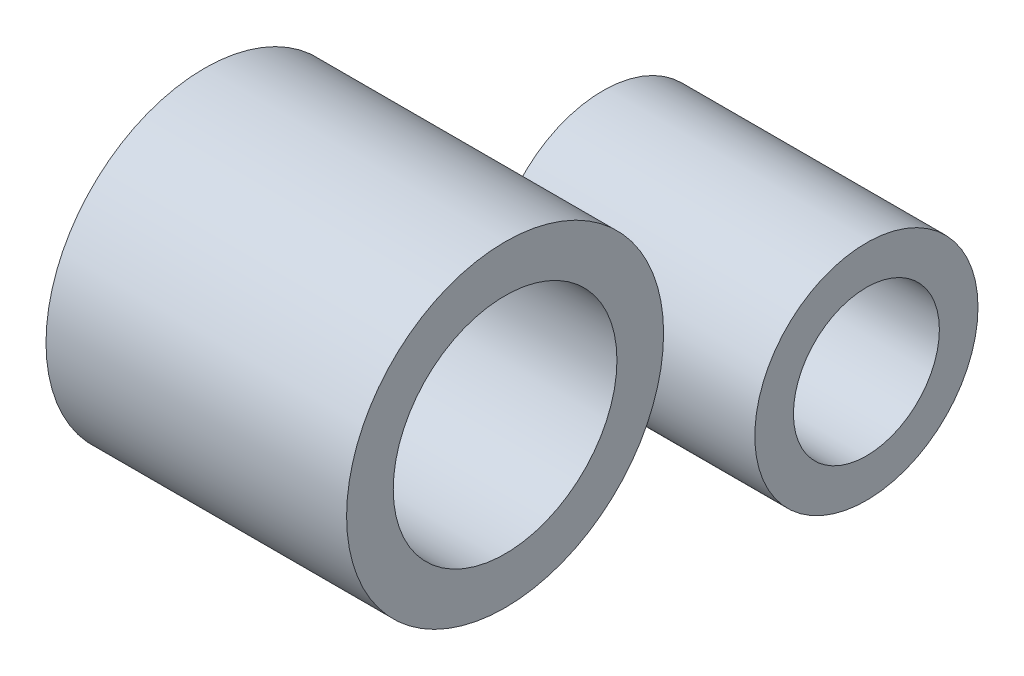
ISO-10303-21;
HEADER;
FILE_DESCRIPTION(('STEP AP214'),'2;1');
FILE_NAME('part.step','',(''),(''),'','','');
FILE_SCHEMA(('AUTOMOTIVE_DESIGN { 1 0 10303 214 1 1 1 1 }'));
ENDSEC;
DATA;
#1=APPLICATION_CONTEXT('core data for automotive mechanical design processes');
#2=APPLICATION_PROTOCOL_DEFINITION('international standard','automotive_design',2000,#1);
#3=PRODUCT_CONTEXT('',#1,'mechanical');
#4=PRODUCT('Part','Part','',(#3));
#5=PRODUCT_RELATED_PRODUCT_CATEGORY('part','',(#4));
#6=PRODUCT_DEFINITION_FORMATION('','',#4);
#7=PRODUCT_DEFINITION_CONTEXT('part definition',#1,'design');
#8=PRODUCT_DEFINITION('design','',#6,#7);
#9=PRODUCT_DEFINITION_SHAPE('','',#8);
#10=(LENGTH_UNIT() NAMED_UNIT(*) SI_UNIT(.MILLI.,.METRE.));
#11=(NAMED_UNIT(*) PLANE_ANGLE_UNIT() SI_UNIT($,.RADIAN.));
#12=(NAMED_UNIT(*) SI_UNIT($,.STERADIAN.) SOLID_ANGLE_UNIT());
#13=UNCERTAINTY_MEASURE_WITH_UNIT(LENGTH_MEASURE(1.E-05),#10,'distance_accuracy_value','');
#14=(GEOMETRIC_REPRESENTATION_CONTEXT(3) GLOBAL_UNCERTAINTY_ASSIGNED_CONTEXT((#13)) GLOBAL_UNIT_ASSIGNED_CONTEXT((#10,
#11,#12)) REPRESENTATION_CONTEXT('',''));
#15=CARTESIAN_POINT('',(0.,0.,0.));
#16=DIRECTION('',(0.,0.,1.));
#17=DIRECTION('',(1.,0.,0.));
#18=AXIS2_PLACEMENT_3D('',#15,#16,#17);
#19=CARTESIAN_POINT('',(73.0000000000001,41.7058257576741,96.7441671801907));
#20=DIRECTION('',(-1.,0.,0.));
#21=DIRECTION('',(0.,0.,1.));
#22=AXIS2_PLACEMENT_3D('',#19,#20,#21);
#23=CYLINDRICAL_SURFACE('',#22,38.4935027632238);
#24=CARTESIAN_POINT('',(73.0000000000001,41.7058257576741,96.7441671801907));
#25=DIRECTION('',(1.,0.,0.));
#26=DIRECTION('',(0.,0.,-1.));
#27=AXIS2_PLACEMENT_3D('',#24,#25,#26);
#28=CIRCLE('',#27,38.4935027632238);
#29=CARTESIAN_POINT('',(73.0000000000001,41.7058257576741,58.2506644169669));
#30=VERTEX_POINT('',#29);
#31=EDGE_CURVE('E11',#30,#30,#28,.T.);
#32=ORIENTED_EDGE('',*,*,#31,.F.);
#33=EDGE_LOOP('',(#32));
#34=FACE_BOUND('',#33,.T.);
#35=CARTESIAN_POINT('',(0.,41.7058257576741,96.7441671801907));
#36=DIRECTION('',(1.,0.,0.));
#37=DIRECTION('',(0.,0.,-1.));
#38=AXIS2_PLACEMENT_3D('',#35,#36,#37);
#39=CIRCLE('',#38,38.4935027632238);
#40=CARTESIAN_POINT('',(0.,41.7058257576741,58.2506644169669));
#41=VERTEX_POINT('',#40);
#42=EDGE_CURVE('E42',#41,#41,#39,.T.);
#43=ORIENTED_EDGE('',*,*,#42,.T.);
#44=EDGE_LOOP('',(#43));
#45=FACE_BOUND('',#44,.T.);
#46=ADVANCED_FACE('F39',(#34,#45),#23,.T.);
#47=CARTESIAN_POINT('',(73.0000000000001,41.7058257576741,96.7441671801907));
#48=DIRECTION('',(1.,0.,0.));
#49=DIRECTION('',(0.,0.,-1.));
#50=AXIS2_PLACEMENT_3D('',#47,#48,#49);
#51=PLANE('',#50);
#52=CARTESIAN_POINT('',(73.0000000000001,41.7058257576741,96.7441671801907));
#53=DIRECTION('',(1.,0.,0.));
#54=DIRECTION('',(0.,0.,-1.));
#55=AXIS2_PLACEMENT_3D('',#52,#53,#54);
#56=CIRCLE('',#55,27.1657190816108);
#57=CARTESIAN_POINT('',(73.0000000000001,41.7058257576741,69.57844809858));
#58=VERTEX_POINT('',#57);
#59=EDGE_CURVE('E49',#58,#58,#56,.T.);
#60=ORIENTED_EDGE('',*,*,#59,.F.);
#61=EDGE_LOOP('',(#60));
#62=FACE_BOUND('',#61,.T.);
#63=ORIENTED_EDGE('',*,*,#31,.T.);
#64=EDGE_LOOP('',(#63));
#65=FACE_BOUND('',#64,.T.);
#66=ADVANCED_FACE('F62',(#62,#65),#51,.T.);
#67=CARTESIAN_POINT('',(0.,41.7058257576741,96.7441671801907));
#68=DIRECTION('',(1.,0.,0.));
#69=DIRECTION('',(0.,0.,-1.));
#70=AXIS2_PLACEMENT_3D('',#67,#68,#69);
#71=PLANE('',#70);
#72=CARTESIAN_POINT('',(0.,41.7058257576741,96.7441671801907));
#73=DIRECTION('',(-1.,0.,0.));
#74=DIRECTION('',(0.,0.,1.));
#75=AXIS2_PLACEMENT_3D('',#72,#73,#74);
#76=CIRCLE('',#75,27.1657190816108);
#77=CARTESIAN_POINT('',(0.,41.7058257576741,123.909886261802));
#78=VERTEX_POINT('',#77);
#79=EDGE_CURVE('E53',#78,#78,#76,.T.);
#80=ORIENTED_EDGE('',*,*,#79,.F.);
#81=EDGE_LOOP('',(#80));
#82=FACE_BOUND('',#81,.T.);
#83=ORIENTED_EDGE('',*,*,#42,.F.);
#84=EDGE_LOOP('',(#83));
#85=FACE_BOUND('',#84,.T.);
#86=ADVANCED_FACE('F59',(#82,#85),#71,.F.);
#87=CARTESIAN_POINT('',(95.0000000000001,41.7058257576741,96.7441671801907));
#88=DIRECTION('',(-1.,0.,0.));
#89=DIRECTION('',(0.,0.,1.));
#90=AXIS2_PLACEMENT_3D('',#87,#88,#89);
#91=CYLINDRICAL_SURFACE('',#90,27.1657190816108);
#92=ORIENTED_EDGE('',*,*,#59,.T.);
#93=EDGE_LOOP('',(#92));
#94=FACE_BOUND('',#93,.T.);
#95=ORIENTED_EDGE('',*,*,#79,.T.);
#96=EDGE_LOOP('',(#95));
#97=FACE_BOUND('',#96,.T.);
#98=ADVANCED_FACE('F57',(#94,#97),#91,.F.);
#99=CLOSED_SHELL('',(#46,#66,#86,#98));
#100=MANIFOLD_SOLID_BREP('B2',#99);
#101=CARTESIAN_POINT('',(64.,0.,0.));
#102=DIRECTION('',(-1.,0.,0.));
#103=DIRECTION('',(0.,0.,1.));
#104=AXIS2_PLACEMENT_3D('',#101,#102,#103);
#105=CYLINDRICAL_SURFACE('',#104,27.1024954491944);
#106=CARTESIAN_POINT('',(64.,0.,0.));
#107=DIRECTION('',(1.,0.,0.));
#108=DIRECTION('',(0.,0.,-1.));
#109=AXIS2_PLACEMENT_3D('',#106,#107,#108);
#110=CIRCLE('',#109,27.1024954491944);
#111=CARTESIAN_POINT('',(64.,0.,-27.1024954491944));
#112=VERTEX_POINT('',#111);
#113=EDGE_CURVE('E38',#112,#112,#110,.T.);
#114=ORIENTED_EDGE('',*,*,#113,.F.);
#115=EDGE_LOOP('',(#114));
#116=FACE_BOUND('',#115,.T.);
#117=CARTESIAN_POINT('',(0.,0.,0.));
#118=DIRECTION('',(1.,0.,0.));
#119=DIRECTION('',(0.,0.,-1.));
#120=AXIS2_PLACEMENT_3D('',#117,#118,#119);
#121=CIRCLE('',#120,27.1024954491944);
#122=CARTESIAN_POINT('',(0.,0.,-27.1024954491944));
#123=VERTEX_POINT('',#122);
#124=EDGE_CURVE('E104',#123,#123,#121,.T.);
#125=ORIENTED_EDGE('',*,*,#124,.T.);
#126=EDGE_LOOP('',(#125));
#127=FACE_BOUND('',#126,.T.);
#128=ADVANCED_FACE('F101',(#116,#127),#105,.T.);
#129=CARTESIAN_POINT('',(64.,0.,0.));
#130=DIRECTION('',(1.,0.,0.));
#131=DIRECTION('',(0.,0.,-1.));
#132=AXIS2_PLACEMENT_3D('',#129,#130,#131);
#133=PLANE('',#132);
#134=CARTESIAN_POINT('',(64.,0.,0.));
#135=DIRECTION('',(1.,0.,0.));
#136=DIRECTION('',(0.,0.,-1.));
#137=AXIS2_PLACEMENT_3D('',#134,#135,#136);
#138=CIRCLE('',#137,17.7221417421169);
#139=CARTESIAN_POINT('',(64.,0.,-17.7221417421169));
#140=VERTEX_POINT('',#139);
#141=EDGE_CURVE('E111',#140,#140,#138,.T.);
#142=ORIENTED_EDGE('',*,*,#141,.F.);
#143=EDGE_LOOP('',(#142));
#144=FACE_BOUND('',#143,.T.);
#145=ORIENTED_EDGE('',*,*,#113,.T.);
#146=EDGE_LOOP('',(#145));
#147=FACE_BOUND('',#146,.T.);
#148=ADVANCED_FACE('F124',(#144,#147),#133,.T.);
#149=CARTESIAN_POINT('',(0.,0.,0.));
#150=DIRECTION('',(1.,0.,0.));
#151=DIRECTION('',(0.,0.,-1.));
#152=AXIS2_PLACEMENT_3D('',#149,#150,#151);
#153=PLANE('',#152);
#154=CARTESIAN_POINT('',(0.,0.,0.));
#155=DIRECTION('',(-1.,0.,0.));
#156=DIRECTION('',(0.,0.,1.));
#157=AXIS2_PLACEMENT_3D('',#154,#155,#156);
#158=CIRCLE('',#157,17.7221417421169);
#159=CARTESIAN_POINT('',(0.,0.,17.7221417421169));
#160=VERTEX_POINT('',#159);
#161=EDGE_CURVE('E115',#160,#160,#158,.T.);
#162=ORIENTED_EDGE('',*,*,#161,.F.);
#163=EDGE_LOOP('',(#162));
#164=FACE_BOUND('',#163,.T.);
#165=ORIENTED_EDGE('',*,*,#124,.F.);
#166=EDGE_LOOP('',(#165));
#167=FACE_BOUND('',#166,.T.);
#168=ADVANCED_FACE('F121',(#164,#167),#153,.F.);
#169=CARTESIAN_POINT('',(95.0000000000001,0.,0.));
#170=DIRECTION('',(-1.,0.,0.));
#171=DIRECTION('',(0.,0.,1.));
#172=AXIS2_PLACEMENT_3D('',#169,#170,#171);
#173=CYLINDRICAL_SURFACE('',#172,17.7221417421169);
#174=ORIENTED_EDGE('',*,*,#141,.T.);
#175=EDGE_LOOP('',(#174));
#176=FACE_BOUND('',#175,.T.);
#177=ORIENTED_EDGE('',*,*,#161,.T.);
#178=EDGE_LOOP('',(#177));
#179=FACE_BOUND('',#178,.T.);
#180=ADVANCED_FACE('F119',(#176,#179),#173,.F.);
#181=CLOSED_SHELL('',(#128,#148,#168,#180));
#182=MANIFOLD_SOLID_BREP('B6',#181);
#183=ADVANCED_BREP_SHAPE_REPRESENTATION('',(#18,#100,#182),#14);
#184=SHAPE_DEFINITION_REPRESENTATION(#9,#183);
ENDSEC;
END-ISO-10303-21;
